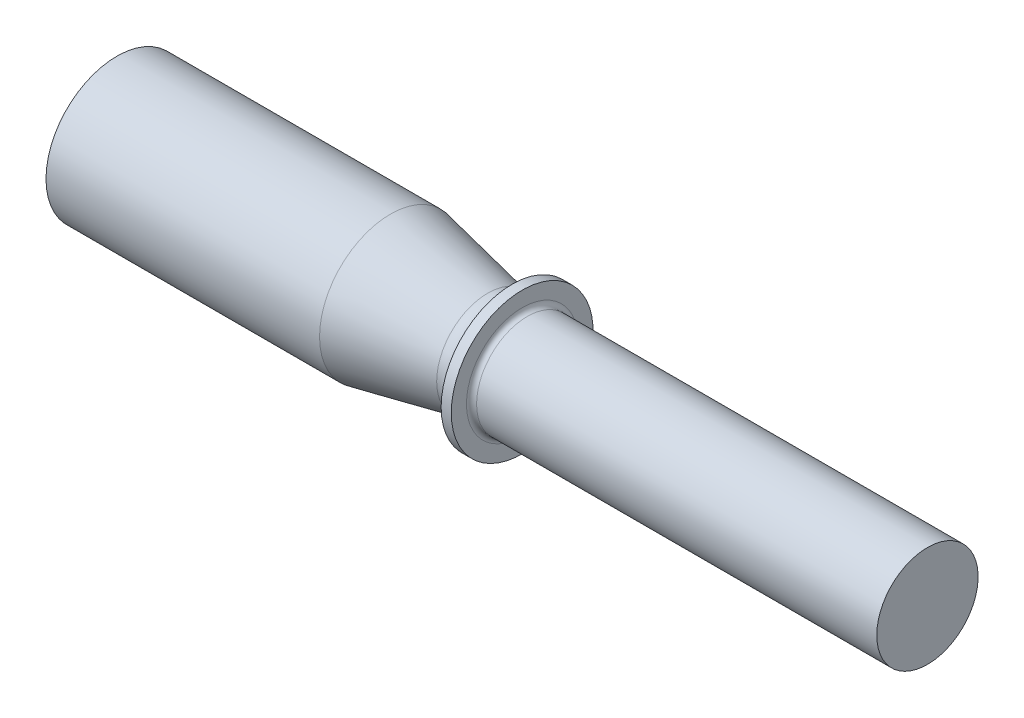
ISO-10303-21;
HEADER;
FILE_DESCRIPTION(('STEP AP214'),'2;1');
FILE_NAME('part.step','',(''),(''),'','','');
FILE_SCHEMA(('AUTOMOTIVE_DESIGN { 1 0 10303 214 1 1 1 1 }'));
ENDSEC;
DATA;
#1=APPLICATION_CONTEXT('core data for automotive mechanical design processes');
#2=APPLICATION_PROTOCOL_DEFINITION('international standard','automotive_design',2000,#1);
#3=PRODUCT_CONTEXT('',#1,'mechanical');
#4=PRODUCT('Part','Part','',(#3));
#5=PRODUCT_RELATED_PRODUCT_CATEGORY('part','',(#4));
#6=PRODUCT_DEFINITION_FORMATION('','',#4);
#7=PRODUCT_DEFINITION_CONTEXT('part definition',#1,'design');
#8=PRODUCT_DEFINITION('design','',#6,#7);
#9=PRODUCT_DEFINITION_SHAPE('','',#8);
#10=(LENGTH_UNIT() NAMED_UNIT(*) SI_UNIT(.MILLI.,.METRE.));
#11=(NAMED_UNIT(*) PLANE_ANGLE_UNIT() SI_UNIT($,.RADIAN.));
#12=(NAMED_UNIT(*) SI_UNIT($,.STERADIAN.) SOLID_ANGLE_UNIT());
#13=UNCERTAINTY_MEASURE_WITH_UNIT(LENGTH_MEASURE(1.E-05),#10,'distance_accuracy_value','');
#14=(GEOMETRIC_REPRESENTATION_CONTEXT(3) GLOBAL_UNCERTAINTY_ASSIGNED_CONTEXT((#13)) GLOBAL_UNIT_ASSIGNED_CONTEXT((#10,
#11,#12)) REPRESENTATION_CONTEXT('',''));
#15=CARTESIAN_POINT('',(0.,0.,0.));
#16=DIRECTION('',(0.,0.,1.));
#17=DIRECTION('',(1.,0.,0.));
#18=AXIS2_PLACEMENT_3D('',#15,#16,#17);
#19=CARTESIAN_POINT('',(-70.8914412551884,0.,0.));
#20=DIRECTION('',(-1.,0.,0.));
#21=DIRECTION('',(0.,0.,1.));
#22=AXIS2_PLACEMENT_3D('',#19,#20,#21);
#23=CYLINDRICAL_SURFACE('',#22,17.78);
#24=CARTESIAN_POINT('',(0.,0.,0.));
#25=DIRECTION('',(-1.,0.,0.));
#26=DIRECTION('',(0.,0.,1.));
#27=AXIS2_PLACEMENT_3D('',#24,#25,#26);
#28=CIRCLE('',#27,17.78);
#29=CARTESIAN_POINT('',(0.,0.,17.78));
#30=VERTEX_POINT('',#29);
#31=EDGE_CURVE('E41',#30,#30,#28,.T.);
#32=ORIENTED_EDGE('',*,*,#31,.F.);
#33=EDGE_LOOP('',(#32));
#34=FACE_BOUND('',#33,.T.);
#35=CARTESIAN_POINT('',(68.58,0.,0.));
#36=DIRECTION('',(-1.,0.,0.));
#37=DIRECTION('',(0.,0.,1.));
#38=AXIS2_PLACEMENT_3D('',#35,#36,#37);
#39=CIRCLE('',#38,17.78);
#40=CARTESIAN_POINT('',(68.58,0.,17.78));
#41=VERTEX_POINT('',#40);
#42=EDGE_CURVE('E59',#41,#41,#39,.T.);
#43=ORIENTED_EDGE('',*,*,#42,.T.);
#44=EDGE_LOOP('',(#43));
#45=FACE_BOUND('',#44,.T.);
#46=ADVANCED_FACE('F30',(#34,#45),#23,.T.);
#47=CARTESIAN_POINT('',(0.,17.78,0.));
#48=DIRECTION('',(1.,0.,0.));
#49=DIRECTION('',(0.,0.,-1.));
#50=AXIS2_PLACEMENT_3D('',#47,#48,#49);
#51=PLANE('',#50);
#52=ORIENTED_EDGE('',*,*,#31,.T.);
#53=EDGE_LOOP('',(#52));
#54=FACE_BOUND('',#53,.T.);
#55=ADVANCED_FACE('F92',(#54),#51,.F.);
#56=CARTESIAN_POINT('',(203.2,0.,0.));
#57=DIRECTION('',(-1.,0.,0.));
#58=DIRECTION('',(0.,0.,1.));
#59=AXIS2_PLACEMENT_3D('',#56,#57,#58);
#60=PLANE('',#59);
#61=CARTESIAN_POINT('',(203.2,0.,0.));
#62=DIRECTION('',(-1.,0.,0.));
#63=DIRECTION('',(0.,0.,1.));
#64=AXIS2_PLACEMENT_3D('',#61,#62,#63);
#65=CIRCLE('',#64,12.7);
#66=CARTESIAN_POINT('',(203.2,0.,12.7));
#67=VERTEX_POINT('',#66);
#68=EDGE_CURVE('E45',#67,#67,#65,.T.);
#69=ORIENTED_EDGE('',*,*,#68,.F.);
#70=EDGE_LOOP('',(#69));
#71=FACE_BOUND('',#70,.T.);
#72=ADVANCED_FACE('F89',(#71),#60,.F.);
#73=CARTESIAN_POINT('',(-70.8914412551884,0.,0.));
#74=DIRECTION('',(-1.,0.,0.));
#75=DIRECTION('',(0.,0.,1.));
#76=AXIS2_PLACEMENT_3D('',#73,#74,#75);
#77=CYLINDRICAL_SURFACE('',#76,12.7);
#78=CARTESIAN_POINT('',(102.87,0.,0.));
#79=DIRECTION('',(-1.,0.,0.));
#80=DIRECTION('',(0.,0.,1.));
#81=AXIS2_PLACEMENT_3D('',#78,#79,#80);
#82=CIRCLE('',#81,12.7);
#83=CARTESIAN_POINT('',(102.87,0.,12.7));
#84=VERTEX_POINT('',#83);
#85=EDGE_CURVE('E10',#84,#84,#82,.F.);
#86=ORIENTED_EDGE('',*,*,#85,.T.);
#87=EDGE_LOOP('',(#86));
#88=FACE_BOUND('',#87,.T.);
#89=ORIENTED_EDGE('',*,*,#68,.T.);
#90=EDGE_LOOP('',(#89));
#91=FACE_BOUND('',#90,.T.);
#92=ADVANCED_FACE('F84',(#88,#91),#77,.T.);
#93=CARTESIAN_POINT('',(101.6,12.7,0.));
#94=DIRECTION('',(-1.,0.,0.));
#95=DIRECTION('',(0.,0.,1.));
#96=AXIS2_PLACEMENT_3D('',#93,#94,#95);
#97=PLANE('',#96);
#98=CARTESIAN_POINT('',(101.6,0.,0.));
#99=DIRECTION('',(-1.,0.,0.));
#100=DIRECTION('',(0.,0.,1.));
#101=AXIS2_PLACEMENT_3D('',#98,#99,#100);
#102=CIRCLE('',#101,13.97);
#103=CARTESIAN_POINT('',(101.6,0.,13.97));
#104=VERTEX_POINT('',#103);
#105=EDGE_CURVE('E37',#104,#104,#102,.T.);
#106=ORIENTED_EDGE('',*,*,#105,.T.);
#107=EDGE_LOOP('',(#106));
#108=FACE_BOUND('',#107,.T.);
#109=CARTESIAN_POINT('',(101.6,0.,0.));
#110=DIRECTION('',(-1.,0.,0.));
#111=DIRECTION('',(0.,0.,1.));
#112=AXIS2_PLACEMENT_3D('',#109,#110,#111);
#113=CIRCLE('',#112,17.78);
#114=CARTESIAN_POINT('',(101.6,0.,17.78));
#115=VERTEX_POINT('',#114);
#116=EDGE_CURVE('E50',#115,#115,#113,.T.);
#117=ORIENTED_EDGE('',*,*,#116,.F.);
#118=EDGE_LOOP('',(#117));
#119=FACE_BOUND('',#118,.T.);
#120=ADVANCED_FACE('F79',(#108,#119),#97,.F.);
#121=CARTESIAN_POINT('',(-70.8914412551884,0.,0.));
#122=DIRECTION('',(-1.,0.,0.));
#123=DIRECTION('',(0.,0.,1.));
#124=AXIS2_PLACEMENT_3D('',#121,#122,#123);
#125=CYLINDRICAL_SURFACE('',#124,17.78);
#126=CARTESIAN_POINT('',(99.06,0.,0.));
#127=DIRECTION('',(-1.,0.,0.));
#128=DIRECTION('',(0.,0.,1.));
#129=AXIS2_PLACEMENT_3D('',#126,#127,#128);
#130=CIRCLE('',#129,17.78);
#131=CARTESIAN_POINT('',(99.06,0.,17.78));
#132=VERTEX_POINT('',#131);
#133=EDGE_CURVE('E53',#132,#132,#130,.T.);
#134=ORIENTED_EDGE('',*,*,#133,.F.);
#135=EDGE_LOOP('',(#134));
#136=FACE_BOUND('',#135,.T.);
#137=ORIENTED_EDGE('',*,*,#116,.T.);
#138=EDGE_LOOP('',(#137));
#139=FACE_BOUND('',#138,.T.);
#140=ADVANCED_FACE('F73',(#136,#139),#125,.T.);
#141=CARTESIAN_POINT('',(93.98,0.,0.));
#142=DIRECTION('',(-1.,0.,0.));
#143=DIRECTION('',(0.,0.,1.));
#144=AXIS2_PLACEMENT_3D('',#141,#142,#143);
#145=TOROIDAL_SURFACE('',#144,17.78,5.08000000000001);
#146=CARTESIAN_POINT('',(92.964,0.,0.));
#147=DIRECTION('',(-1.,0.,0.));
#148=DIRECTION('',(0.,0.,1.));
#149=AXIS2_PLACEMENT_3D('',#146,#147,#148);
#150=CIRCLE('',#149,12.8026368426646);
#151=CARTESIAN_POINT('',(92.964,0.,12.8026368426646));
#152=VERTEX_POINT('',#151);
#153=EDGE_CURVE('E56',#152,#152,#150,.T.);
#154=ORIENTED_EDGE('',*,*,#153,.F.);
#155=EDGE_LOOP('',(#154));
#156=FACE_BOUND('',#155,.T.);
#157=ORIENTED_EDGE('',*,*,#133,.T.);
#158=EDGE_LOOP('',(#157));
#159=FACE_BOUND('',#158,.T.);
#160=ADVANCED_FACE('F67',(#156,#159),#145,.F.);
#161=CARTESIAN_POINT('',(92.964,0.,0.));
#162=DIRECTION('',(-1.,0.,0.));
#163=DIRECTION('',(0.,0.,1.));
#164=AXIS2_PLACEMENT_3D('',#161,#162,#163);
#165=CONICAL_SURFACE('',#164,12.8026368426646,0.201357920790332);
#166=ORIENTED_EDGE('',*,*,#42,.F.);
#167=EDGE_LOOP('',(#166));
#168=FACE_BOUND('',#167,.T.);
#169=ORIENTED_EDGE('',*,*,#153,.T.);
#170=EDGE_LOOP('',(#169));
#171=FACE_BOUND('',#170,.T.);
#172=ADVANCED_FACE('F64',(#168,#171),#165,.T.);
#173=CARTESIAN_POINT('',(102.87,0.,0.));
#174=DIRECTION('',(-1.,0.,0.));
#175=DIRECTION('',(0.,0.,1.));
#176=AXIS2_PLACEMENT_3D('',#173,#174,#175);
#177=TOROIDAL_SURFACE('',#176,13.97,1.27);
#178=ORIENTED_EDGE('',*,*,#85,.F.);
#179=EDGE_LOOP('',(#178));
#180=FACE_BOUND('',#179,.T.);
#181=ORIENTED_EDGE('',*,*,#105,.F.);
#182=EDGE_LOOP('',(#181));
#183=FACE_BOUND('',#182,.T.);
#184=ADVANCED_FACE('F32',(#180,#183),#177,.F.);
#185=CLOSED_SHELL('',(#46,#55,#72,#92,#120,#140,#160,#172,#184));
#186=MANIFOLD_SOLID_BREP('B2',#185);
#187=ADVANCED_BREP_SHAPE_REPRESENTATION('',(#18,#186),#14);
#188=SHAPE_DEFINITION_REPRESENTATION(#9,#187);
ENDSEC;
END-ISO-10303-21;
